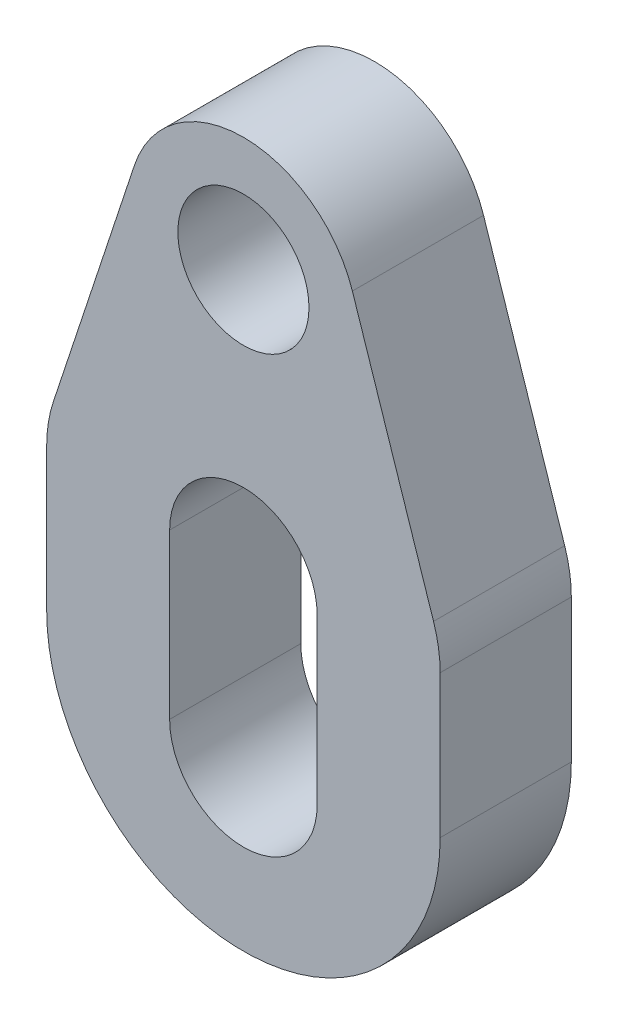
ISO-10303-21;
HEADER;
FILE_DESCRIPTION(('STEP AP214'),'2;1');
FILE_NAME('part.step','',(''),(''),'','','');
FILE_SCHEMA(('AUTOMOTIVE_DESIGN { 1 0 10303 214 1 1 1 1 }'));
ENDSEC;
DATA;
#1=APPLICATION_CONTEXT('core data for automotive mechanical design processes');
#2=APPLICATION_PROTOCOL_DEFINITION('international standard','automotive_design',2000,#1);
#3=PRODUCT_CONTEXT('',#1,'mechanical');
#4=PRODUCT('Part','Part','',(#3));
#5=PRODUCT_RELATED_PRODUCT_CATEGORY('part','',(#4));
#6=PRODUCT_DEFINITION_FORMATION('','',#4);
#7=PRODUCT_DEFINITION_CONTEXT('part definition',#1,'design');
#8=PRODUCT_DEFINITION('design','',#6,#7);
#9=PRODUCT_DEFINITION_SHAPE('','',#8);
#10=(LENGTH_UNIT() NAMED_UNIT(*) SI_UNIT(.MILLI.,.METRE.));
#11=(NAMED_UNIT(*) PLANE_ANGLE_UNIT() SI_UNIT($,.RADIAN.));
#12=(NAMED_UNIT(*) SI_UNIT($,.STERADIAN.) SOLID_ANGLE_UNIT());
#13=UNCERTAINTY_MEASURE_WITH_UNIT(LENGTH_MEASURE(1.E-05),#10,'distance_accuracy_value','');
#14=(GEOMETRIC_REPRESENTATION_CONTEXT(3) GLOBAL_UNCERTAINTY_ASSIGNED_CONTEXT((#13)) GLOBAL_UNIT_ASSIGNED_CONTEXT((#10,
#11,#12)) REPRESENTATION_CONTEXT('',''));
#15=CARTESIAN_POINT('',(0.,0.,0.));
#16=DIRECTION('',(0.,0.,1.));
#17=DIRECTION('',(1.,0.,0.));
#18=AXIS2_PLACEMENT_3D('',#15,#16,#17);
#19=CARTESIAN_POINT('',(-9.525,7.93749999999999,6.35));
#20=DIRECTION('',(1.,0.,0.));
#21=DIRECTION('',(0.,1.,0.));
#22=AXIS2_PLACEMENT_3D('',#19,#20,#21);
#23=PLANE('',#22);
#24=DIRECTION('',(0.,-1.,0.));
#25=VECTOR('',#24,1.);
#26=CARTESIAN_POINT('',(-9.525,7.93749999999999,6.35));
#27=LINE('',#26,#25);
#28=CARTESIAN_POINT('',(-9.525,-1.02225712598016,6.35));
#29=VERTEX_POINT('',#28);
#30=CARTESIAN_POINT('',(-9.525,-7.9375,6.35));
#31=VERTEX_POINT('',#30);
#32=EDGE_CURVE('E203',#29,#31,#27,.T.);
#33=ORIENTED_EDGE('',*,*,#32,.F.);
#34=DIRECTION('',(0.,0.,1.));
#35=VECTOR('',#34,1.);
#36=CARTESIAN_POINT('',(-9.525,-1.02225712598016,0.));
#37=LINE('',#36,#35);
#38=CARTESIAN_POINT('',(-9.525,-1.02225712598016,0.));
#39=VERTEX_POINT('',#38);
#40=EDGE_CURVE('E52',#29,#39,#37,.F.);
#41=ORIENTED_EDGE('',*,*,#40,.T.);
#42=DIRECTION('',(0.,-1.,0.));
#43=VECTOR('',#42,1.);
#44=CARTESIAN_POINT('',(-9.525,7.93749999999999,0.));
#45=LINE('',#44,#43);
#46=CARTESIAN_POINT('',(-9.525,-7.9375,0.));
#47=VERTEX_POINT('',#46);
#48=EDGE_CURVE('E202',#39,#47,#45,.T.);
#49=ORIENTED_EDGE('',*,*,#48,.T.);
#50=DIRECTION('',(0.,0.,-1.));
#51=VECTOR('',#50,1.);
#52=CARTESIAN_POINT('',(-9.525,-7.9375,6.35));
#53=LINE('',#52,#51);
#54=EDGE_CURVE('E219',#31,#47,#53,.T.);
#55=ORIENTED_EDGE('',*,*,#54,.F.);
#56=EDGE_LOOP('',(#33,#41,#49,#55));
#57=FACE_BOUND('',#56,.T.);
#58=ADVANCED_FACE('F44',(#57),#23,.F.);
#59=CARTESIAN_POINT('',(9.52499999999999,7.93750000000001,6.35));
#60=DIRECTION('',(-1.,0.,0.));
#61=DIRECTION('',(0.,-1.,0.));
#62=AXIS2_PLACEMENT_3D('',#59,#60,#61);
#63=PLANE('',#62);
#64=DIRECTION('',(0.,1.,0.));
#65=VECTOR('',#64,1.);
#66=CARTESIAN_POINT('',(9.52499999999999,7.93750000000001,0.));
#67=LINE('',#66,#65);
#68=CARTESIAN_POINT('',(9.525,-7.9375,0.));
#69=VERTEX_POINT('',#68);
#70=CARTESIAN_POINT('',(9.525,-1.02225712598016,0.));
#71=VERTEX_POINT('',#70);
#72=EDGE_CURVE('E206',#69,#71,#67,.T.);
#73=ORIENTED_EDGE('',*,*,#72,.T.);
#74=DIRECTION('',(0.,0.,1.));
#75=VECTOR('',#74,1.);
#76=CARTESIAN_POINT('',(9.525,-1.02225712598016,6.35));
#77=LINE('',#76,#75);
#78=CARTESIAN_POINT('',(9.525,-1.02225712598016,6.35));
#79=VERTEX_POINT('',#78);
#80=EDGE_CURVE('E227',#71,#79,#77,.T.);
#81=ORIENTED_EDGE('',*,*,#80,.T.);
#82=DIRECTION('',(0.,1.,0.));
#83=VECTOR('',#82,1.);
#84=CARTESIAN_POINT('',(9.52499999999999,7.93750000000001,6.35));
#85=LINE('',#84,#83);
#86=CARTESIAN_POINT('',(9.525,-7.9375,6.35));
#87=VERTEX_POINT('',#86);
#88=EDGE_CURVE('E208',#87,#79,#85,.T.);
#89=ORIENTED_EDGE('',*,*,#88,.F.);
#90=DIRECTION('',(0.,0.,-1.));
#91=VECTOR('',#90,1.);
#92=CARTESIAN_POINT('',(9.525,-7.9375,6.35));
#93=LINE('',#92,#91);
#94=EDGE_CURVE('E211',#87,#69,#93,.T.);
#95=ORIENTED_EDGE('',*,*,#94,.T.);
#96=EDGE_LOOP('',(#73,#81,#89,#95));
#97=FACE_BOUND('',#96,.T.);
#98=ADVANCED_FACE('F245',(#97),#63,.F.);
#99=CARTESIAN_POINT('',(0.,7.9375,6.35));
#100=DIRECTION('',(0.,0.,1.));
#101=DIRECTION('',(1.,0.,0.));
#102=AXIS2_PLACEMENT_3D('',#99,#100,#101);
#103=PLANE('',#102);
#104=DIRECTION('',(0.,-1.,0.));
#105=VECTOR('',#104,1.);
#106=CARTESIAN_POINT('',(-3.571875,-9.525,6.35));
#107=LINE('',#106,#105);
#108=CARTESIAN_POINT('',(-3.571875,-1.5875,6.35));
#109=VERTEX_POINT('',#108);
#110=CARTESIAN_POINT('',(-3.571875,-9.525,6.35));
#111=VERTEX_POINT('',#110);
#112=EDGE_CURVE('E182',#109,#111,#107,.T.);
#113=ORIENTED_EDGE('',*,*,#112,.F.);
#114=CARTESIAN_POINT('',(0.,-1.5875,6.35));
#115=DIRECTION('',(0.,0.,1.));
#116=DIRECTION('',(1.,0.,0.));
#117=AXIS2_PLACEMENT_3D('',#114,#115,#116);
#118=CIRCLE('',#117,3.571875);
#119=CARTESIAN_POINT('',(3.571875,-1.5875,6.35));
#120=VERTEX_POINT('',#119);
#121=EDGE_CURVE('E179',#120,#109,#118,.T.);
#122=ORIENTED_EDGE('',*,*,#121,.F.);
#123=DIRECTION('',(0.,1.,0.));
#124=VECTOR('',#123,1.);
#125=CARTESIAN_POINT('',(3.571875,-9.525,6.35));
#126=LINE('',#125,#124);
#127=CARTESIAN_POINT('',(3.571875,-9.525,6.35));
#128=VERTEX_POINT('',#127);
#129=EDGE_CURVE('E176',#128,#120,#126,.T.);
#130=ORIENTED_EDGE('',*,*,#129,.F.);
#131=CARTESIAN_POINT('',(0.,-9.525,6.35));
#132=DIRECTION('',(0.,0.,1.));
#133=DIRECTION('',(1.,0.,0.));
#134=AXIS2_PLACEMENT_3D('',#131,#132,#133);
#135=CIRCLE('',#134,3.571875);
#136=EDGE_CURVE('E190',#111,#128,#135,.T.);
#137=ORIENTED_EDGE('',*,*,#136,.F.);
#138=EDGE_LOOP('',(#113,#122,#130,#137));
#139=FACE_BOUND('',#138,.T.);
#140=CARTESIAN_POINT('',(0.,11.1125,6.35));
#141=DIRECTION('',(0.,0.,1.));
#142=DIRECTION('',(1.,0.,0.));
#143=AXIS2_PLACEMENT_3D('',#140,#141,#142);
#144=CIRCLE('',#143,3.175);
#145=CARTESIAN_POINT('',(3.175,11.1125,6.35));
#146=VERTEX_POINT('',#145);
#147=EDGE_CURVE('E196',#146,#146,#144,.T.);
#148=ORIENTED_EDGE('',*,*,#147,.F.);
#149=EDGE_LOOP('',(#148));
#150=FACE_BOUND('',#149,.T.);
#151=ORIENTED_EDGE('',*,*,#88,.T.);
#152=CARTESIAN_POINT('',(3.175,-1.02225712598016,6.35));
#153=DIRECTION('',(0.,0.,1.));
#154=DIRECTION('',(1.,0.,0.));
#155=AXIS2_PLACEMENT_3D('',#152,#153,#154);
#156=CIRCLE('',#155,6.35);
#157=CARTESIAN_POINT('',(9.20417763385506,0.970609417324182,6.35));
#158=VERTEX_POINT('',#157);
#159=EDGE_CURVE('E230',#79,#158,#156,.T.);
#160=ORIENTED_EDGE('',*,*,#159,.T.);
#161=DIRECTION('',(0.31383725091407,-0.949476792733082,0.));
#162=VECTOR('',#161,1.);
#163=CARTESIAN_POINT('',(8.58684636391611,2.8382708008225,6.35));
#164=LINE('',#163,#162);
#165=CARTESIAN_POINT('',(5.27553042962318,12.8562582253913,6.35));
#166=VERTEX_POINT('',#165);
#167=EDGE_CURVE('E157',#166,#158,#164,.T.);
#168=ORIENTED_EDGE('',*,*,#167,.F.);
#169=CARTESIAN_POINT('',(0.,11.1125,6.35));
#170=DIRECTION('',(0.,0.,1.));
#171=DIRECTION('',(1.,0.,0.));
#172=AXIS2_PLACEMENT_3D('',#169,#170,#171);
#173=CIRCLE('',#172,5.55625);
#174=CARTESIAN_POINT('',(-5.27553042962318,12.8562582253913,6.35));
#175=VERTEX_POINT('',#174);
#176=EDGE_CURVE('E150',#166,#175,#173,.T.);
#177=ORIENTED_EDGE('',*,*,#176,.T.);
#178=DIRECTION('',(0.31383725091407,0.949476792733082,0.));
#179=VECTOR('',#178,1.);
#180=CARTESIAN_POINT('',(-8.58684636391611,2.83827080082251,6.35));
#181=LINE('',#180,#179);
#182=CARTESIAN_POINT('',(-9.20417763385507,0.970609417324181,6.35));
#183=VERTEX_POINT('',#182);
#184=EDGE_CURVE('E160',#183,#175,#181,.T.);
#185=ORIENTED_EDGE('',*,*,#184,.F.);
#186=CARTESIAN_POINT('',(-3.175,-1.02225712598016,6.35));
#187=DIRECTION('',(0.,0.,1.));
#188=DIRECTION('',(1.,0.,0.));
#189=AXIS2_PLACEMENT_3D('',#186,#187,#188);
#190=CIRCLE('',#189,6.35);
#191=EDGE_CURVE('E59',#183,#29,#190,.T.);
#192=ORIENTED_EDGE('',*,*,#191,.T.);
#193=ORIENTED_EDGE('',*,*,#32,.T.);
#194=CARTESIAN_POINT('',(0.,-7.9375,6.35));
#195=DIRECTION('',(0.,0.,1.));
#196=DIRECTION('',(1.,0.,0.));
#197=AXIS2_PLACEMENT_3D('',#194,#195,#196);
#198=CIRCLE('',#197,9.525);
#199=EDGE_CURVE('E205',#31,#87,#198,.T.);
#200=ORIENTED_EDGE('',*,*,#199,.T.);
#201=EDGE_LOOP('',(#151,#160,#168,#177,#185,#192,#193,#200));
#202=FACE_BOUND('',#201,.T.);
#203=ADVANCED_FACE('F248',(#139,#150,#202),#103,.T.);
#204=CARTESIAN_POINT('',(0.,7.9375,0.));
#205=DIRECTION('',(0.,0.,1.));
#206=DIRECTION('',(1.,0.,0.));
#207=AXIS2_PLACEMENT_3D('',#204,#205,#206);
#208=PLANE('',#207);
#209=CARTESIAN_POINT('',(0.,11.1125,0.));
#210=DIRECTION('',(0.,0.,1.));
#211=DIRECTION('',(1.,0.,0.));
#212=AXIS2_PLACEMENT_3D('',#209,#210,#211);
#213=CIRCLE('',#212,3.175);
#214=CARTESIAN_POINT('',(3.175,11.1125,0.));
#215=VERTEX_POINT('',#214);
#216=EDGE_CURVE('E199',#215,#215,#213,.T.);
#217=ORIENTED_EDGE('',*,*,#216,.T.);
#218=EDGE_LOOP('',(#217));
#219=FACE_BOUND('',#218,.T.);
#220=CARTESIAN_POINT('',(0.,-1.5875,0.));
#221=DIRECTION('',(0.,0.,1.));
#222=DIRECTION('',(1.,0.,0.));
#223=AXIS2_PLACEMENT_3D('',#220,#221,#222);
#224=CIRCLE('',#223,3.571875);
#225=CARTESIAN_POINT('',(-3.571875,-1.5875,0.));
#226=VERTEX_POINT('',#225);
#227=CARTESIAN_POINT('',(3.571875,-1.5875,0.));
#228=VERTEX_POINT('',#227);
#229=EDGE_CURVE('E170',#226,#228,#224,.F.);
#230=ORIENTED_EDGE('',*,*,#229,.F.);
#231=DIRECTION('',(0.,1.,0.));
#232=VECTOR('',#231,1.);
#233=CARTESIAN_POINT('',(-3.571875,-9.525,0.));
#234=LINE('',#233,#232);
#235=CARTESIAN_POINT('',(-3.571875,-9.525,0.));
#236=VERTEX_POINT('',#235);
#237=EDGE_CURVE('E173',#236,#226,#234,.T.);
#238=ORIENTED_EDGE('',*,*,#237,.F.);
#239=CARTESIAN_POINT('',(0.,-9.525,0.));
#240=DIRECTION('',(0.,0.,1.));
#241=DIRECTION('',(1.,0.,0.));
#242=AXIS2_PLACEMENT_3D('',#239,#240,#241);
#243=CIRCLE('',#242,3.571875);
#244=CARTESIAN_POINT('',(3.571875,-9.525,0.));
#245=VERTEX_POINT('',#244);
#246=EDGE_CURVE('E193',#236,#245,#243,.T.);
#247=ORIENTED_EDGE('',*,*,#246,.T.);
#248=DIRECTION('',(0.,-1.,0.));
#249=VECTOR('',#248,1.);
#250=CARTESIAN_POINT('',(3.571875,-9.525,0.));
#251=LINE('',#250,#249);
#252=EDGE_CURVE('E187',#228,#245,#251,.T.);
#253=ORIENTED_EDGE('',*,*,#252,.F.);
#254=EDGE_LOOP('',(#230,#238,#247,#253));
#255=FACE_BOUND('',#254,.T.);
#256=DIRECTION('',(0.31383725091407,-0.949476792733082,0.));
#257=VECTOR('',#256,1.);
#258=CARTESIAN_POINT('',(8.58684636391611,2.8382708008225,0.));
#259=LINE('',#258,#257);
#260=CARTESIAN_POINT('',(5.27553042962318,12.8562582253913,0.));
#261=VERTEX_POINT('',#260);
#262=CARTESIAN_POINT('',(9.20417763385506,0.970609417324182,0.));
#263=VERTEX_POINT('',#262);
#264=EDGE_CURVE('E133',#261,#263,#259,.T.);
#265=ORIENTED_EDGE('',*,*,#264,.T.);
#266=CARTESIAN_POINT('',(3.175,-1.02225712598016,0.));
#267=DIRECTION('',(0.,0.,1.));
#268=DIRECTION('',(1.,0.,0.));
#269=AXIS2_PLACEMENT_3D('',#266,#267,#268);
#270=CIRCLE('',#269,6.35);
#271=EDGE_CURVE('E225',#263,#71,#270,.F.);
#272=ORIENTED_EDGE('',*,*,#271,.T.);
#273=ORIENTED_EDGE('',*,*,#72,.F.);
#274=CARTESIAN_POINT('',(0.,-7.9375,0.));
#275=DIRECTION('',(0.,0.,1.));
#276=DIRECTION('',(1.,0.,0.));
#277=AXIS2_PLACEMENT_3D('',#274,#275,#276);
#278=CIRCLE('',#277,9.525);
#279=EDGE_CURVE('E213',#47,#69,#278,.T.);
#280=ORIENTED_EDGE('',*,*,#279,.F.);
#281=ORIENTED_EDGE('',*,*,#48,.F.);
#282=CARTESIAN_POINT('',(-3.175,-1.02225712598016,0.));
#283=DIRECTION('',(0.,0.,1.));
#284=DIRECTION('',(1.,0.,0.));
#285=AXIS2_PLACEMENT_3D('',#282,#283,#284);
#286=CIRCLE('',#285,6.35);
#287=CARTESIAN_POINT('',(-9.20417763385507,0.970609417324181,0.));
#288=VERTEX_POINT('',#287);
#289=EDGE_CURVE('E223',#39,#288,#286,.F.);
#290=ORIENTED_EDGE('',*,*,#289,.T.);
#291=DIRECTION('',(0.31383725091407,0.949476792733082,0.));
#292=VECTOR('',#291,1.);
#293=CARTESIAN_POINT('',(-8.58684636391611,2.83827080082251,0.));
#294=LINE('',#293,#292);
#295=CARTESIAN_POINT('',(-5.27553042962318,12.8562582253913,0.));
#296=VERTEX_POINT('',#295);
#297=EDGE_CURVE('E154',#288,#296,#294,.T.);
#298=ORIENTED_EDGE('',*,*,#297,.T.);
#299=CARTESIAN_POINT('',(0.,11.1125,0.));
#300=DIRECTION('',(0.,0.,1.));
#301=DIRECTION('',(1.,0.,0.));
#302=AXIS2_PLACEMENT_3D('',#299,#300,#301);
#303=CIRCLE('',#302,5.55625);
#304=EDGE_CURVE('E143',#261,#296,#303,.T.);
#305=ORIENTED_EDGE('',*,*,#304,.F.);
#306=EDGE_LOOP('',(#265,#272,#273,#280,#281,#290,#298,#305));
#307=FACE_BOUND('',#306,.T.);
#308=ADVANCED_FACE('F153',(#219,#255,#307),#208,.F.);
#309=CARTESIAN_POINT('',(0.,-9.525,6.35));
#310=DIRECTION('',(0.,0.,1.));
#311=DIRECTION('',(1.,0.,0.));
#312=AXIS2_PLACEMENT_3D('',#309,#310,#311);
#313=CYLINDRICAL_SURFACE('',#312,3.571875);
#314=DIRECTION('',(0.,0.,1.));
#315=VECTOR('',#314,1.);
#316=CARTESIAN_POINT('',(-3.571875,-9.525,6.35));
#317=LINE('',#316,#315);
#318=EDGE_CURVE('E167',#236,#111,#317,.T.);
#319=ORIENTED_EDGE('',*,*,#318,.T.);
#320=ORIENTED_EDGE('',*,*,#136,.T.);
#321=DIRECTION('',(0.,0.,1.));
#322=VECTOR('',#321,1.);
#323=CARTESIAN_POINT('',(3.571875,-9.525,6.35));
#324=LINE('',#323,#322);
#325=EDGE_CURVE('E165',#245,#128,#324,.T.);
#326=ORIENTED_EDGE('',*,*,#325,.F.);
#327=ORIENTED_EDGE('',*,*,#246,.F.);
#328=EDGE_LOOP('',(#319,#320,#326,#327));
#329=FACE_BOUND('',#328,.T.);
#330=ADVANCED_FACE('F267',(#329),#313,.F.);
#331=CARTESIAN_POINT('',(0.,-7.9375,6.35));
#332=DIRECTION('',(0.,0.,-1.));
#333=DIRECTION('',(-1.,0.,0.));
#334=AXIS2_PLACEMENT_3D('',#331,#332,#333);
#335=CYLINDRICAL_SURFACE('',#334,9.525);
#336=ORIENTED_EDGE('',*,*,#279,.T.);
#337=ORIENTED_EDGE('',*,*,#94,.F.);
#338=ORIENTED_EDGE('',*,*,#199,.F.);
#339=ORIENTED_EDGE('',*,*,#54,.T.);
#340=EDGE_LOOP('',(#336,#337,#338,#339));
#341=FACE_BOUND('',#340,.T.);
#342=ADVANCED_FACE('F241',(#341),#335,.T.);
#343=CARTESIAN_POINT('',(0.,11.1125,6.35));
#344=DIRECTION('',(0.,0.,1.));
#345=DIRECTION('',(1.,0.,0.));
#346=AXIS2_PLACEMENT_3D('',#343,#344,#345);
#347=CYLINDRICAL_SURFACE('',#346,3.175);
#348=ORIENTED_EDGE('',*,*,#216,.F.);
#349=EDGE_LOOP('',(#348));
#350=FACE_BOUND('',#349,.T.);
#351=ORIENTED_EDGE('',*,*,#147,.T.);
#352=EDGE_LOOP('',(#351));
#353=FACE_BOUND('',#352,.T.);
#354=ADVANCED_FACE('F266',(#350,#353),#347,.F.);
#355=CARTESIAN_POINT('',(-3.571875,-9.525,-0.00100000000000013));
#356=DIRECTION('',(-1.,0.,0.));
#357=DIRECTION('',(0.,0.,1.));
#358=AXIS2_PLACEMENT_3D('',#355,#356,#357);
#359=PLANE('',#358);
#360=ORIENTED_EDGE('',*,*,#237,.T.);
#361=DIRECTION('',(0.,0.,1.));
#362=VECTOR('',#361,1.);
#363=CARTESIAN_POINT('',(-3.571875,-1.5875,-0.00100000000000013));
#364=LINE('',#363,#362);
#365=EDGE_CURVE('E185',#226,#109,#364,.T.);
#366=ORIENTED_EDGE('',*,*,#365,.T.);
#367=ORIENTED_EDGE('',*,*,#112,.T.);
#368=ORIENTED_EDGE('',*,*,#318,.F.);
#369=EDGE_LOOP('',(#360,#366,#367,#368));
#370=FACE_BOUND('',#369,.T.);
#371=ADVANCED_FACE('F277',(#370),#359,.F.);
#372=CARTESIAN_POINT('',(0.,-1.5875,-0.00100000000000013));
#373=DIRECTION('',(0.,0.,1.));
#374=DIRECTION('',(1.,0.,0.));
#375=AXIS2_PLACEMENT_3D('',#372,#373,#374);
#376=CYLINDRICAL_SURFACE('',#375,3.571875);
#377=ORIENTED_EDGE('',*,*,#229,.T.);
#378=DIRECTION('',(0.,0.,1.));
#379=VECTOR('',#378,1.);
#380=CARTESIAN_POINT('',(3.571875,-1.5875,-0.00100000000000013));
#381=LINE('',#380,#379);
#382=EDGE_CURVE('E184',#228,#120,#381,.T.);
#383=ORIENTED_EDGE('',*,*,#382,.T.);
#384=ORIENTED_EDGE('',*,*,#121,.T.);
#385=ORIENTED_EDGE('',*,*,#365,.F.);
#386=EDGE_LOOP('',(#377,#383,#384,#385));
#387=FACE_BOUND('',#386,.T.);
#388=ADVANCED_FACE('F285',(#387),#376,.F.);
#389=CARTESIAN_POINT('',(3.571875,-9.525,-0.00100000000000013));
#390=DIRECTION('',(1.,0.,0.));
#391=DIRECTION('',(0.,0.,-1.));
#392=AXIS2_PLACEMENT_3D('',#389,#390,#391);
#393=PLANE('',#392);
#394=ORIENTED_EDGE('',*,*,#252,.T.);
#395=ORIENTED_EDGE('',*,*,#325,.T.);
#396=ORIENTED_EDGE('',*,*,#129,.T.);
#397=ORIENTED_EDGE('',*,*,#382,.F.);
#398=EDGE_LOOP('',(#394,#395,#396,#397));
#399=FACE_BOUND('',#398,.T.);
#400=ADVANCED_FACE('F282',(#399),#393,.F.);
#401=CARTESIAN_POINT('',(0.,11.1125,6.35));
#402=DIRECTION('',(0.,0.,1.));
#403=DIRECTION('',(1.,0.,0.));
#404=AXIS2_PLACEMENT_3D('',#401,#402,#403);
#405=CYLINDRICAL_SURFACE('',#404,5.55625);
#406=DIRECTION('',(0.,0.,1.));
#407=VECTOR('',#406,1.);
#408=CARTESIAN_POINT('',(-5.27553042962318,12.8562582253913,6.35));
#409=LINE('',#408,#407);
#410=EDGE_CURVE('E151',#175,#296,#409,.F.);
#411=ORIENTED_EDGE('',*,*,#410,.F.);
#412=ORIENTED_EDGE('',*,*,#176,.F.);
#413=DIRECTION('',(0.,0.,1.));
#414=VECTOR('',#413,1.);
#415=CARTESIAN_POINT('',(5.27553042962318,12.8562582253913,6.35));
#416=LINE('',#415,#414);
#417=EDGE_CURVE('E137',#166,#261,#416,.F.);
#418=ORIENTED_EDGE('',*,*,#417,.T.);
#419=ORIENTED_EDGE('',*,*,#304,.T.);
#420=EDGE_LOOP('',(#411,#412,#418,#419));
#421=FACE_BOUND('',#420,.T.);
#422=ADVANCED_FACE('F148',(#421),#405,.T.);
#423=CARTESIAN_POINT('',(8.58684636391611,2.8382708008225,6.35));
#424=DIRECTION('',(-0.949476792733082,-0.31383725091407,0.));
#425=DIRECTION('',(0.31383725091407,-0.949476792733082,0.));
#426=AXIS2_PLACEMENT_3D('',#423,#424,#425);
#427=PLANE('',#426);
#428=ORIENTED_EDGE('',*,*,#167,.T.);
#429=DIRECTION('',(0.,0.,-1.));
#430=VECTOR('',#429,1.);
#431=CARTESIAN_POINT('',(9.20417763385506,0.970609417324182,0.));
#432=LINE('',#431,#430);
#433=EDGE_CURVE('E140',#158,#263,#432,.T.);
#434=ORIENTED_EDGE('',*,*,#433,.T.);
#435=ORIENTED_EDGE('',*,*,#264,.F.);
#436=ORIENTED_EDGE('',*,*,#417,.F.);
#437=EDGE_LOOP('',(#428,#434,#435,#436));
#438=FACE_BOUND('',#437,.T.);
#439=ADVANCED_FACE('F136',(#438),#427,.F.);
#440=CARTESIAN_POINT('',(-8.58684636391611,2.83827080082251,6.35));
#441=DIRECTION('',(0.949476792733082,-0.31383725091407,0.));
#442=DIRECTION('',(0.31383725091407,0.949476792733082,0.));
#443=AXIS2_PLACEMENT_3D('',#440,#441,#442);
#444=PLANE('',#443);
#445=ORIENTED_EDGE('',*,*,#297,.F.);
#446=DIRECTION('',(0.,0.,-1.));
#447=VECTOR('',#446,1.);
#448=CARTESIAN_POINT('',(-9.20417763385507,0.970609417324181,6.35));
#449=LINE('',#448,#447);
#450=EDGE_CURVE('E11',#288,#183,#449,.F.);
#451=ORIENTED_EDGE('',*,*,#450,.T.);
#452=ORIENTED_EDGE('',*,*,#184,.T.);
#453=ORIENTED_EDGE('',*,*,#410,.T.);
#454=EDGE_LOOP('',(#445,#451,#452,#453));
#455=FACE_BOUND('',#454,.T.);
#456=ADVANCED_FACE('F252',(#455),#444,.F.);
#457=CARTESIAN_POINT('',(3.175,-1.02225712598016,6.35));
#458=DIRECTION('',(0.,0.,-1.));
#459=DIRECTION('',(-1.,0.,0.));
#460=AXIS2_PLACEMENT_3D('',#457,#458,#459);
#461=CYLINDRICAL_SURFACE('',#460,6.35);
#462=ORIENTED_EDGE('',*,*,#159,.F.);
#463=ORIENTED_EDGE('',*,*,#80,.F.);
#464=ORIENTED_EDGE('',*,*,#271,.F.);
#465=ORIENTED_EDGE('',*,*,#433,.F.);
#466=EDGE_LOOP('',(#462,#463,#464,#465));
#467=FACE_BOUND('',#466,.T.);
#468=ADVANCED_FACE('F250',(#467),#461,.T.);
#469=CARTESIAN_POINT('',(-3.175,-1.02225712598016,6.35));
#470=DIRECTION('',(0.,0.,-1.));
#471=DIRECTION('',(-1.,0.,0.));
#472=AXIS2_PLACEMENT_3D('',#469,#470,#471);
#473=CYLINDRICAL_SURFACE('',#472,6.35);
#474=ORIENTED_EDGE('',*,*,#191,.F.);
#475=ORIENTED_EDGE('',*,*,#450,.F.);
#476=ORIENTED_EDGE('',*,*,#289,.F.);
#477=ORIENTED_EDGE('',*,*,#40,.F.);
#478=EDGE_LOOP('',(#474,#475,#476,#477));
#479=FACE_BOUND('',#478,.T.);
#480=ADVANCED_FACE('F46',(#479),#473,.T.);
#481=CLOSED_SHELL('',(#58,#98,#203,#308,#330,#342,#354,#371,#388,#400,#422,#439,#456,#468,#480));
#482=MANIFOLD_SOLID_BREP('B2',#481);
#483=ADVANCED_BREP_SHAPE_REPRESENTATION('',(#18,#482),#14);
#484=SHAPE_DEFINITION_REPRESENTATION(#9,#483);
ENDSEC;
END-ISO-10303-21;
